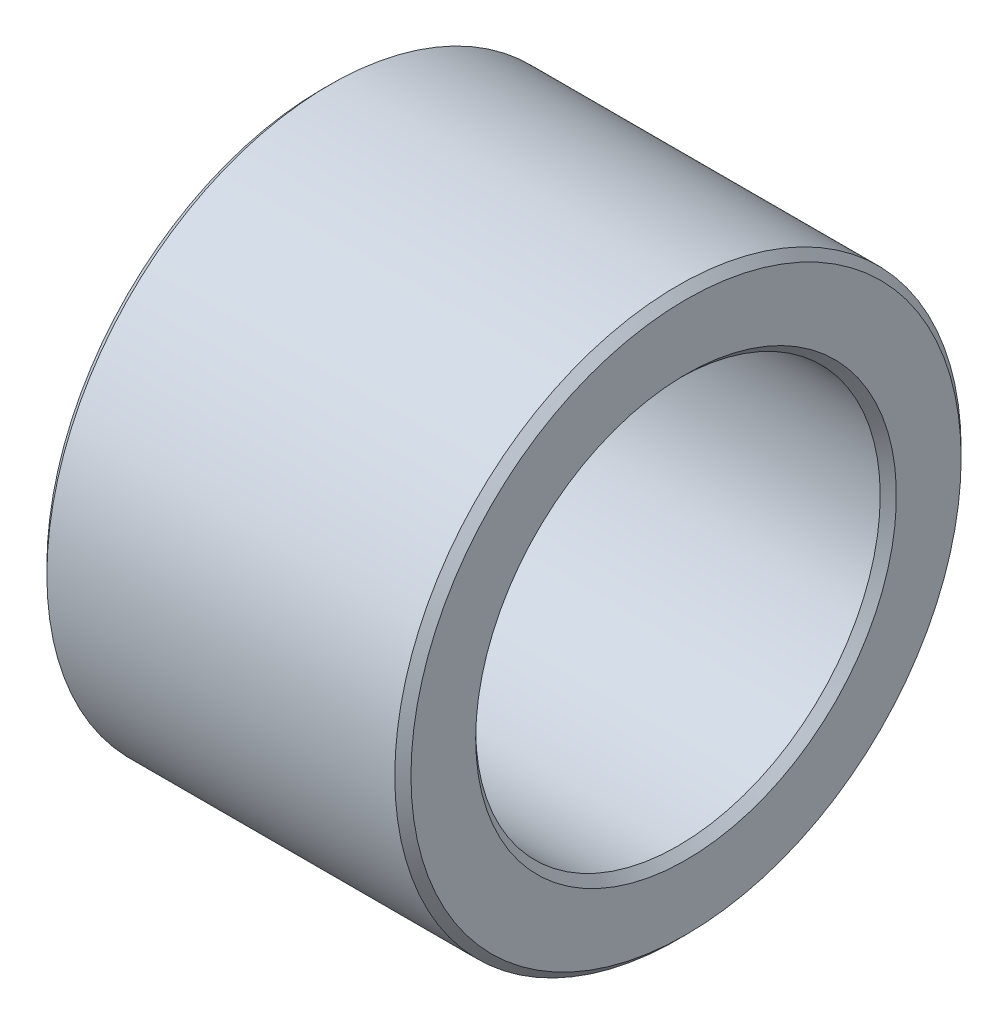
ISO-10303-21;
HEADER;
FILE_DESCRIPTION(('STEP AP214'),'2;1');
FILE_NAME('part.step','',(''),(''),'','','');
FILE_SCHEMA(('AUTOMOTIVE_DESIGN { 1 0 10303 214 1 1 1 1 }'));
ENDSEC;
DATA;
#1=APPLICATION_CONTEXT('core data for automotive mechanical design processes');
#2=APPLICATION_PROTOCOL_DEFINITION('international standard','automotive_design',2000,#1);
#3=PRODUCT_CONTEXT('',#1,'mechanical');
#4=PRODUCT('Part','Part','',(#3));
#5=PRODUCT_RELATED_PRODUCT_CATEGORY('part','',(#4));
#6=PRODUCT_DEFINITION_FORMATION('','',#4);
#7=PRODUCT_DEFINITION_CONTEXT('part definition',#1,'design');
#8=PRODUCT_DEFINITION('design','',#6,#7);
#9=PRODUCT_DEFINITION_SHAPE('','',#8);
#10=(LENGTH_UNIT() NAMED_UNIT(*) SI_UNIT(.MILLI.,.METRE.));
#11=(NAMED_UNIT(*) PLANE_ANGLE_UNIT() SI_UNIT($,.RADIAN.));
#12=(NAMED_UNIT(*) SI_UNIT($,.STERADIAN.) SOLID_ANGLE_UNIT());
#13=UNCERTAINTY_MEASURE_WITH_UNIT(LENGTH_MEASURE(1.E-05),#10,'distance_accuracy_value','');
#14=(GEOMETRIC_REPRESENTATION_CONTEXT(3) GLOBAL_UNCERTAINTY_ASSIGNED_CONTEXT((#13)) GLOBAL_UNIT_ASSIGNED_CONTEXT((#10,
#11,#12)) REPRESENTATION_CONTEXT('',''));
#15=CARTESIAN_POINT('',(0.,0.,0.));
#16=DIRECTION('',(0.,0.,1.));
#17=DIRECTION('',(1.,0.,0.));
#18=AXIS2_PLACEMENT_3D('',#15,#16,#17);
#19=CARTESIAN_POINT('',(0.,0.,0.));
#20=DIRECTION('',(-1.,0.,0.));
#21=DIRECTION('',(0.,0.,1.));
#22=AXIS2_PLACEMENT_3D('',#19,#20,#21);
#23=CONICAL_SURFACE('',#22,5.2,0.785398163397448);
#24=CARTESIAN_POINT('',(0.2,0.,0.));
#25=DIRECTION('',(-1.,0.,0.));
#26=DIRECTION('',(0.,0.,1.));
#27=AXIS2_PLACEMENT_3D('',#24,#25,#26);
#28=CIRCLE('',#27,5.);
#29=CARTESIAN_POINT('',(0.2,0.,5.));
#30=VERTEX_POINT('',#29);
#31=EDGE_CURVE('E10',#30,#30,#28,.T.);
#32=ORIENTED_EDGE('',*,*,#31,.F.);
#33=EDGE_LOOP('',(#32));
#34=FACE_BOUND('',#33,.T.);
#35=CARTESIAN_POINT('',(0.,0.,0.));
#36=DIRECTION('',(-1.,0.,0.));
#37=DIRECTION('',(0.,0.,1.));
#38=AXIS2_PLACEMENT_3D('',#35,#36,#37);
#39=CIRCLE('',#38,5.2);
#40=CARTESIAN_POINT('',(0.,0.,5.2));
#41=VERTEX_POINT('',#40);
#42=EDGE_CURVE('E61',#41,#41,#39,.T.);
#43=ORIENTED_EDGE('',*,*,#42,.T.);
#44=EDGE_LOOP('',(#43));
#45=FACE_BOUND('',#44,.T.);
#46=ADVANCED_FACE('F33',(#34,#45),#23,.F.);
#47=CARTESIAN_POINT('',(0.,0.,0.));
#48=DIRECTION('',(-1.,0.,0.));
#49=DIRECTION('',(0.,0.,1.));
#50=AXIS2_PLACEMENT_3D('',#47,#48,#49);
#51=CYLINDRICAL_SURFACE('',#50,5.);
#52=CARTESIAN_POINT('',(8.8,0.,0.));
#53=DIRECTION('',(-1.,0.,0.));
#54=DIRECTION('',(0.,0.,1.));
#55=AXIS2_PLACEMENT_3D('',#52,#53,#54);
#56=CIRCLE('',#55,5.);
#57=CARTESIAN_POINT('',(8.8,0.,5.));
#58=VERTEX_POINT('',#57);
#59=EDGE_CURVE('E39',#58,#58,#56,.T.);
#60=ORIENTED_EDGE('',*,*,#59,.F.);
#61=EDGE_LOOP('',(#60));
#62=FACE_BOUND('',#61,.T.);
#63=ORIENTED_EDGE('',*,*,#31,.T.);
#64=EDGE_LOOP('',(#63));
#65=FACE_BOUND('',#64,.T.);
#66=ADVANCED_FACE('F98',(#62,#65),#51,.F.);
#67=CARTESIAN_POINT('',(8.8,0.,0.));
#68=DIRECTION('',(1.,0.,0.));
#69=DIRECTION('',(0.,0.,-1.));
#70=AXIS2_PLACEMENT_3D('',#67,#68,#69);
#71=CONICAL_SURFACE('',#70,5.,0.785398163397446);
#72=CARTESIAN_POINT('',(9.,0.,0.));
#73=DIRECTION('',(-1.,0.,0.));
#74=DIRECTION('',(0.,0.,1.));
#75=AXIS2_PLACEMENT_3D('',#72,#73,#74);
#76=CIRCLE('',#75,5.2);
#77=CARTESIAN_POINT('',(9.,0.,5.2));
#78=VERTEX_POINT('',#77);
#79=EDGE_CURVE('E43',#78,#78,#76,.T.);
#80=ORIENTED_EDGE('',*,*,#79,.F.);
#81=EDGE_LOOP('',(#80));
#82=FACE_BOUND('',#81,.T.);
#83=ORIENTED_EDGE('',*,*,#59,.T.);
#84=EDGE_LOOP('',(#83));
#85=FACE_BOUND('',#84,.T.);
#86=ADVANCED_FACE('F93',(#82,#85),#71,.F.);
#87=CARTESIAN_POINT('',(9.,5.2,0.));
#88=DIRECTION('',(-1.,0.,0.));
#89=DIRECTION('',(0.,0.,1.));
#90=AXIS2_PLACEMENT_3D('',#87,#88,#89);
#91=PLANE('',#90);
#92=CARTESIAN_POINT('',(9.,0.,0.));
#93=DIRECTION('',(-1.,0.,0.));
#94=DIRECTION('',(0.,0.,1.));
#95=AXIS2_PLACEMENT_3D('',#92,#93,#94);
#96=CIRCLE('',#95,6.8);
#97=CARTESIAN_POINT('',(9.,0.,6.8));
#98=VERTEX_POINT('',#97);
#99=EDGE_CURVE('E47',#98,#98,#96,.T.);
#100=ORIENTED_EDGE('',*,*,#99,.F.);
#101=EDGE_LOOP('',(#100));
#102=FACE_BOUND('',#101,.T.);
#103=ORIENTED_EDGE('',*,*,#79,.T.);
#104=EDGE_LOOP('',(#103));
#105=FACE_BOUND('',#104,.T.);
#106=ADVANCED_FACE('F87',(#102,#105),#91,.F.);
#107=CARTESIAN_POINT('',(9.,0.,0.));
#108=DIRECTION('',(-1.,0.,0.));
#109=DIRECTION('',(0.,0.,1.));
#110=AXIS2_PLACEMENT_3D('',#107,#108,#109);
#111=CONICAL_SURFACE('',#110,6.8,0.785398163397446);
#112=CARTESIAN_POINT('',(8.8,0.,0.));
#113=DIRECTION('',(-1.,0.,0.));
#114=DIRECTION('',(0.,0.,1.));
#115=AXIS2_PLACEMENT_3D('',#112,#113,#114);
#116=CIRCLE('',#115,7.);
#117=CARTESIAN_POINT('',(8.8,0.,7.));
#118=VERTEX_POINT('',#117);
#119=EDGE_CURVE('E52',#118,#118,#116,.T.);
#120=ORIENTED_EDGE('',*,*,#119,.F.);
#121=EDGE_LOOP('',(#120));
#122=FACE_BOUND('',#121,.T.);
#123=ORIENTED_EDGE('',*,*,#99,.T.);
#124=EDGE_LOOP('',(#123));
#125=FACE_BOUND('',#124,.T.);
#126=ADVANCED_FACE('F81',(#122,#125),#111,.T.);
#127=CARTESIAN_POINT('',(0.,0.,0.));
#128=DIRECTION('',(-1.,0.,0.));
#129=DIRECTION('',(0.,0.,1.));
#130=AXIS2_PLACEMENT_3D('',#127,#128,#129);
#131=CYLINDRICAL_SURFACE('',#130,7.);
#132=CARTESIAN_POINT('',(0.2,0.,0.));
#133=DIRECTION('',(-1.,0.,0.));
#134=DIRECTION('',(0.,0.,1.));
#135=AXIS2_PLACEMENT_3D('',#132,#133,#134);
#136=CIRCLE('',#135,7.);
#137=CARTESIAN_POINT('',(0.2,0.,7.));
#138=VERTEX_POINT('',#137);
#139=EDGE_CURVE('E55',#138,#138,#136,.T.);
#140=ORIENTED_EDGE('',*,*,#139,.F.);
#141=EDGE_LOOP('',(#140));
#142=FACE_BOUND('',#141,.T.);
#143=ORIENTED_EDGE('',*,*,#119,.T.);
#144=EDGE_LOOP('',(#143));
#145=FACE_BOUND('',#144,.T.);
#146=ADVANCED_FACE('F75',(#142,#145),#131,.T.);
#147=CARTESIAN_POINT('',(0.2,0.,0.));
#148=DIRECTION('',(1.,0.,0.));
#149=DIRECTION('',(0.,0.,-1.));
#150=AXIS2_PLACEMENT_3D('',#147,#148,#149);
#151=CONICAL_SURFACE('',#150,7.,0.785398163397447);
#152=CARTESIAN_POINT('',(0.,0.,0.));
#153=DIRECTION('',(-1.,0.,0.));
#154=DIRECTION('',(0.,0.,1.));
#155=AXIS2_PLACEMENT_3D('',#152,#153,#154);
#156=CIRCLE('',#155,6.8);
#157=CARTESIAN_POINT('',(0.,0.,6.8));
#158=VERTEX_POINT('',#157);
#159=EDGE_CURVE('E58',#158,#158,#156,.T.);
#160=ORIENTED_EDGE('',*,*,#159,.F.);
#161=EDGE_LOOP('',(#160));
#162=FACE_BOUND('',#161,.T.);
#163=ORIENTED_EDGE('',*,*,#139,.T.);
#164=EDGE_LOOP('',(#163));
#165=FACE_BOUND('',#164,.T.);
#166=ADVANCED_FACE('F69',(#162,#165),#151,.T.);
#167=CARTESIAN_POINT('',(0.,6.8,0.));
#168=DIRECTION('',(1.,0.,0.));
#169=DIRECTION('',(0.,0.,-1.));
#170=AXIS2_PLACEMENT_3D('',#167,#168,#169);
#171=PLANE('',#170);
#172=ORIENTED_EDGE('',*,*,#42,.F.);
#173=EDGE_LOOP('',(#172));
#174=FACE_BOUND('',#173,.T.);
#175=ORIENTED_EDGE('',*,*,#159,.T.);
#176=EDGE_LOOP('',(#175));
#177=FACE_BOUND('',#176,.T.);
#178=ADVANCED_FACE('F66',(#174,#177),#171,.F.);
#179=CLOSED_SHELL('',(#46,#66,#86,#106,#126,#146,#166,#178));
#180=MANIFOLD_SOLID_BREP('B2',#179);
#181=ADVANCED_BREP_SHAPE_REPRESENTATION('',(#18,#180),#14);
#182=SHAPE_DEFINITION_REPRESENTATION(#9,#181);
ENDSEC;
END-ISO-10303-21;
